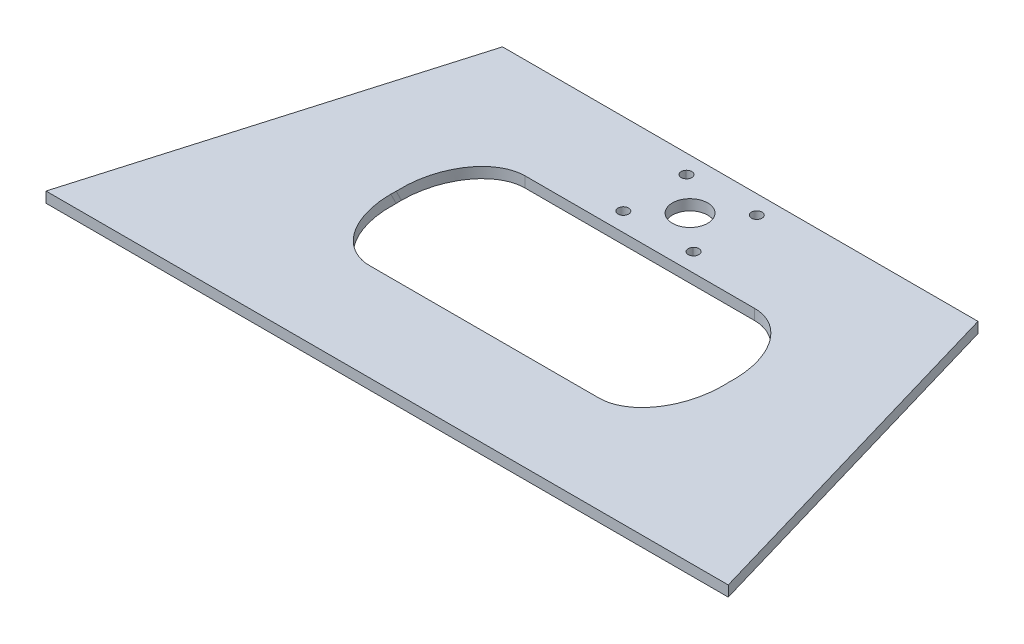
ISO-10303-21;
HEADER;
FILE_DESCRIPTION(('STEP AP214'),'2;1');
FILE_NAME('part.step','',(''),(''),'','','');
FILE_SCHEMA(('AUTOMOTIVE_DESIGN { 1 0 10303 214 1 1 1 1 }'));
ENDSEC;
DATA;
#1=APPLICATION_CONTEXT('core data for automotive mechanical design processes');
#2=APPLICATION_PROTOCOL_DEFINITION('international standard','automotive_design',2000,#1);
#3=PRODUCT_CONTEXT('',#1,'mechanical');
#4=PRODUCT('Part','Part','',(#3));
#5=PRODUCT_RELATED_PRODUCT_CATEGORY('part','',(#4));
#6=PRODUCT_DEFINITION_FORMATION('','',#4);
#7=PRODUCT_DEFINITION_CONTEXT('part definition',#1,'design');
#8=PRODUCT_DEFINITION('design','',#6,#7);
#9=PRODUCT_DEFINITION_SHAPE('','',#8);
#10=(LENGTH_UNIT() NAMED_UNIT(*) SI_UNIT(.MILLI.,.METRE.));
#11=(NAMED_UNIT(*) PLANE_ANGLE_UNIT() SI_UNIT($,.RADIAN.));
#12=(NAMED_UNIT(*) SI_UNIT($,.STERADIAN.) SOLID_ANGLE_UNIT());
#13=UNCERTAINTY_MEASURE_WITH_UNIT(LENGTH_MEASURE(1.E-05),#10,'distance_accuracy_value','');
#14=(GEOMETRIC_REPRESENTATION_CONTEXT(3) GLOBAL_UNCERTAINTY_ASSIGNED_CONTEXT((#13)) GLOBAL_UNIT_ASSIGNED_CONTEXT((#10,
#11,#12)) REPRESENTATION_CONTEXT('',''));
#15=CARTESIAN_POINT('',(0.,0.,0.));
#16=DIRECTION('',(0.,0.,1.));
#17=DIRECTION('',(1.,0.,0.));
#18=AXIS2_PLACEMENT_3D('',#15,#16,#17);
#19=CARTESIAN_POINT('',(0.,3.,0.));
#20=DIRECTION('',(0.,-1.,0.));
#21=DIRECTION('',(0.,0.,-1.));
#22=AXIS2_PLACEMENT_3D('',#19,#20,#21);
#23=PLANE('',#22);
#24=CARTESIAN_POINT('',(106.549966595721,3.,-76.8289375530703));
#25=DIRECTION('',(0.,1.,0.));
#26=DIRECTION('',(0.,0.,1.));
#27=AXIS2_PLACEMENT_3D('',#24,#25,#26);
#28=CIRCLE('',#27,1.5);
#29=CARTESIAN_POINT('',(105.434765336458,3.,-77.8320956419767));
#30=VERTEX_POINT('',#29);
#31=CARTESIAN_POINT('',(107.665201259541,3.,-75.8258166009341));
#32=VERTEX_POINT('',#31);
#33=EDGE_CURVE('E60',#30,#32,#28,.T.);
#34=ORIENTED_EDGE('',*,*,#33,.F.);
#35=CARTESIAN_POINT('',(106.55,3.,-76.8289746895307));
#36=DIRECTION('',(0.,-1.,0.));
#37=DIRECTION('',(0.,0.,-1.));
#38=AXIS2_PLACEMENT_3D('',#35,#36,#37);
#39=CIRCLE('',#38,1.49999999999999);
#40=EDGE_CURVE('E253',#30,#32,#39,.T.);
#41=ORIENTED_EDGE('',*,*,#40,.T.);
#42=EDGE_LOOP('',(#34,#41));
#43=FACE_BOUND('',#42,.T.);
#44=CARTESIAN_POINT('',(106.550033404139,3.,-94.7289375529457));
#45=DIRECTION('',(0.,1.,0.));
#46=DIRECTION('',(0.,0.,1.));
#47=AXIS2_PLACEMENT_3D('',#44,#45,#46);
#48=CIRCLE('',#47,1.5);
#49=CARTESIAN_POINT('',(105.434794998551,3.,-93.7258207607913));
#50=VERTEX_POINT('',#49);
#51=CARTESIAN_POINT('',(107.665238405309,3.,-95.7320914819947));
#52=VERTEX_POINT('',#51);
#53=EDGE_CURVE('E354',#50,#52,#48,.T.);
#54=ORIENTED_EDGE('',*,*,#53,.F.);
#55=CARTESIAN_POINT('',(106.55,3.,-94.7289746895306));
#56=DIRECTION('',(0.,-1.,0.));
#57=DIRECTION('',(0.,0.,-1.));
#58=AXIS2_PLACEMENT_3D('',#55,#56,#57);
#59=CIRCLE('',#58,1.49999999999999);
#60=EDGE_CURVE('E247',#50,#52,#59,.T.);
#61=ORIENTED_EDGE('',*,*,#60,.T.);
#62=EDGE_LOOP('',(#54,#61));
#63=FACE_BOUND('',#62,.T.);
#64=DIRECTION('',(1.,0.,0.));
#65=VECTOR('',#64,1.);
#66=CARTESIAN_POINT('',(0.,3.,0.));
#67=LINE('',#66,#65);
#68=CARTESIAN_POINT('',(0.,3.,0.));
#69=VERTEX_POINT('',#68);
#70=CARTESIAN_POINT('',(193.2,3.,0.));
#71=VERTEX_POINT('',#70);
#72=EDGE_CURVE('E225',#69,#71,#67,.T.);
#73=ORIENTED_EDGE('',*,*,#72,.T.);
#74=DIRECTION('',(-0.281001727065255,0.,-0.959707262339066));
#75=VECTOR('',#74,1.);
#76=CARTESIAN_POINT('',(193.2,3.,0.));
#77=LINE('',#76,#75);
#78=CARTESIAN_POINT('',(163.92005828315,3.,-100.));
#79=VERTEX_POINT('',#78);
#80=EDGE_CURVE('E196',#71,#79,#77,.T.);
#81=ORIENTED_EDGE('',*,*,#80,.T.);
#82=DIRECTION('',(-1.,0.,0.));
#83=VECTOR('',#82,1.);
#84=CARTESIAN_POINT('',(29.2799417168491,3.,-100.));
#85=LINE('',#84,#83);
#86=CARTESIAN_POINT('',(29.2799417168491,3.,-100.));
#87=VERTEX_POINT('',#86);
#88=EDGE_CURVE('E215',#79,#87,#85,.T.);
#89=ORIENTED_EDGE('',*,*,#88,.T.);
#90=DIRECTION('',(-0.281001727065247,0.,0.959707262339068));
#91=VECTOR('',#90,1.);
#92=CARTESIAN_POINT('',(0.,3.,0.));
#93=LINE('',#92,#91);
#94=EDGE_CURVE('E221',#87,#69,#93,.T.);
#95=ORIENTED_EDGE('',*,*,#94,.T.);
#96=EDGE_LOOP('',(#73,#81,#89,#95));
#97=FACE_BOUND('',#96,.T.);
#98=CARTESIAN_POINT('',(96.5999999999996,3.,-85.7789746895304));
#99=DIRECTION('',(0.,-1.,0.));
#100=DIRECTION('',(0.,0.,-1.));
#101=AXIS2_PLACEMENT_3D('',#98,#99,#100);
#102=CIRCLE('',#101,5.);
#103=CARTESIAN_POINT('',(96.5999999999996,3.,-90.7789746895304));
#104=VERTEX_POINT('',#103);
#105=EDGE_CURVE('E259',#104,#104,#102,.T.);
#106=ORIENTED_EDGE('',*,*,#105,.T.);
#107=EDGE_LOOP('',(#106));
#108=FACE_BOUND('',#107,.T.);
#109=CARTESIAN_POINT('',(64.0999999999994,2.99999999999998,-48.0395752908427));
#110=DIRECTION('',(0.,-1.,0.));
#111=DIRECTION('',(0.,0.,1.));
#112=AXIS2_PLACEMENT_3D('',#109,#110,#111);
#113=ELLIPSE('',#112,20.5155954288015,14.5);
#114=CARTESIAN_POINT('',(49.5999999999994,3.,-48.0395752908427));
#115=VERTEX_POINT('',#114);
#116=CARTESIAN_POINT('',(49.6388811468373,3.,-49.5409646205514));
#117=VERTEX_POINT('',#116);
#118=EDGE_CURVE('E298',#115,#117,#113,.T.);
#119=ORIENTED_EDGE('',*,*,#118,.T.);
#120=CARTESIAN_POINT('',(64.0999999999994,3.,-51.04235395026));
#121=DIRECTION('',(0.,-1.,0.));
#122=DIRECTION('',(0.,0.,-1.));
#123=AXIS2_PLACEMENT_3D('',#120,#121,#122);
#124=ELLIPSE('',#123,20.5155954288015,14.5);
#125=CARTESIAN_POINT('',(64.0999999999995,3.,-71.5579493790615));
#126=VERTEX_POINT('',#125);
#127=EDGE_CURVE('E250',#117,#126,#124,.T.);
#128=ORIENTED_EDGE('',*,*,#127,.T.);
#129=DIRECTION('',(1.,0.,0.));
#130=VECTOR('',#129,1.);
#131=CARTESIAN_POINT('',(9.19999999999997,3.,-71.5579493790615));
#132=LINE('',#131,#130);
#133=CARTESIAN_POINT('',(129.1,3.,-71.5579493790615));
#134=VERTEX_POINT('',#133);
#135=EDGE_CURVE('E283',#126,#134,#132,.T.);
#136=ORIENTED_EDGE('',*,*,#135,.T.);
#137=CARTESIAN_POINT('',(129.1,3.,-51.04235395026));
#138=DIRECTION('',(0.,-1.,0.));
#139=DIRECTION('',(0.,0.,-1.));
#140=AXIS2_PLACEMENT_3D('',#137,#138,#139);
#141=ELLIPSE('',#140,20.5155954288015,14.5);
#142=CARTESIAN_POINT('',(143.561118853162,3.,-49.5409646205496));
#143=VERTEX_POINT('',#142);
#144=EDGE_CURVE('E286',#134,#143,#141,.T.);
#145=ORIENTED_EDGE('',*,*,#144,.T.);
#146=CARTESIAN_POINT('',(129.1,2.99999999999998,-48.0395752908427));
#147=DIRECTION('',(0.,-1.,0.));
#148=DIRECTION('',(0.,0.,1.));
#149=AXIS2_PLACEMENT_3D('',#146,#147,#148);
#150=ELLIPSE('',#149,20.5155954288015,14.5);
#151=CARTESIAN_POINT('',(143.6,3.,-48.0395752908427));
#152=VERTEX_POINT('',#151);
#153=EDGE_CURVE('E289',#143,#152,#150,.T.);
#154=ORIENTED_EDGE('',*,*,#153,.T.);
#155=CARTESIAN_POINT('',(129.1,3.,-48.0395752908427));
#156=DIRECTION('',(0.,1.,0.));
#157=DIRECTION('',(0.,0.,-1.));
#158=AXIS2_PLACEMENT_3D('',#155,#156,#157);
#159=ELLIPSE('',#158,20.5155954288014,14.5);
#160=CARTESIAN_POINT('',(129.1,3.,-27.5239798620413));
#161=VERTEX_POINT('',#160);
#162=EDGE_CURVE('E262',#161,#152,#159,.T.);
#163=ORIENTED_EDGE('',*,*,#162,.F.);
#164=DIRECTION('',(-1.,0.,0.));
#165=VECTOR('',#164,1.);
#166=CARTESIAN_POINT('',(96.5999999999995,2.99999999999998,-27.5239798620412));
#167=LINE('',#166,#165);
#168=CARTESIAN_POINT('',(64.0999999999994,3.,-27.5239798620412));
#169=VERTEX_POINT('',#168);
#170=EDGE_CURVE('E292',#161,#169,#167,.T.);
#171=ORIENTED_EDGE('',*,*,#170,.T.);
#172=EDGE_CURVE('E295',#169,#115,#113,.T.);
#173=ORIENTED_EDGE('',*,*,#172,.T.);
#174=EDGE_LOOP('',(#119,#128,#136,#145,#154,#163,#171,#173));
#175=FACE_BOUND('',#174,.T.);
#176=CARTESIAN_POINT('',(86.64996659586,3.,-76.8290118261159));
#177=DIRECTION('',(0.,1.,0.));
#178=DIRECTION('',(0.,0.,1.));
#179=AXIS2_PLACEMENT_3D('',#176,#177,#178);
#180=CIRCLE('',#179,1.5);
#181=CARTESIAN_POINT('',(87.7652050061699,3.,-77.8321286130203));
#182=VERTEX_POINT('',#181);
#183=CARTESIAN_POINT('',(85.5347615899683,3.,-75.8258579023165));
#184=VERTEX_POINT('',#183);
#185=EDGE_CURVE('E346',#182,#184,#180,.T.);
#186=ORIENTED_EDGE('',*,*,#185,.F.);
#187=CARTESIAN_POINT('',(86.6499999999996,3.,-76.8289746895307));
#188=DIRECTION('',(0.,-1.,0.));
#189=DIRECTION('',(0.,0.,-1.));
#190=AXIS2_PLACEMENT_3D('',#187,#188,#189);
#191=CIRCLE('',#190,1.49999999999999);
#192=EDGE_CURVE('E246',#182,#184,#191,.T.);
#193=ORIENTED_EDGE('',*,*,#192,.T.);
#194=EDGE_LOOP('',(#186,#193));
#195=FACE_BOUND('',#194,.T.);
#196=CARTESIAN_POINT('',(86.6500334042779,3.,-94.7290118259911));
#197=DIRECTION('',(0.,1.,0.));
#198=DIRECTION('',(0.,0.,1.));
#199=AXIS2_PLACEMENT_3D('',#196,#197,#198);
#200=CIRCLE('',#199,1.5);
#201=CARTESIAN_POINT('',(87.7652346652798,3.,-93.7258537390179));
#202=VERTEX_POINT('',#201);
#203=CARTESIAN_POINT('',(85.534798738719,3.,-95.732132776194));
#204=VERTEX_POINT('',#203);
#205=EDGE_CURVE('E52',#202,#204,#200,.T.);
#206=ORIENTED_EDGE('',*,*,#205,.F.);
#207=CARTESIAN_POINT('',(86.6499999999996,3.,-94.7289746895306));
#208=DIRECTION('',(0.,-1.,0.));
#209=DIRECTION('',(0.,0.,-1.));
#210=AXIS2_PLACEMENT_3D('',#207,#208,#209);
#211=CIRCLE('',#210,1.49999999999999);
#212=EDGE_CURVE('E183',#202,#204,#211,.T.);
#213=ORIENTED_EDGE('',*,*,#212,.T.);
#214=EDGE_LOOP('',(#206,#213));
#215=FACE_BOUND('',#214,.T.);
#216=ADVANCED_FACE('F38',(#43,#63,#97,#108,#175,#195,#215),#23,.F.);
#217=CARTESIAN_POINT('',(0.,0.,0.));
#218=DIRECTION('',(0.,-1.,0.));
#219=DIRECTION('',(0.,0.,-1.));
#220=AXIS2_PLACEMENT_3D('',#217,#218,#219);
#221=PLANE('',#220);
#222=DIRECTION('',(-1.,0.,0.));
#223=VECTOR('',#222,1.);
#224=CARTESIAN_POINT('',(29.2799417168491,0.,-100.));
#225=LINE('',#224,#223);
#226=CARTESIAN_POINT('',(163.92005828315,0.,-100.));
#227=VERTEX_POINT('',#226);
#228=CARTESIAN_POINT('',(29.2799417168491,0.,-100.));
#229=VERTEX_POINT('',#228);
#230=EDGE_CURVE('E224',#227,#229,#225,.T.);
#231=ORIENTED_EDGE('',*,*,#230,.F.);
#232=DIRECTION('',(-0.281001727065255,0.,-0.959707262339066));
#233=VECTOR('',#232,1.);
#234=CARTESIAN_POINT('',(193.2,0.,0.));
#235=LINE('',#234,#233);
#236=CARTESIAN_POINT('',(193.2,0.,0.));
#237=VERTEX_POINT('',#236);
#238=EDGE_CURVE('E200',#237,#227,#235,.T.);
#239=ORIENTED_EDGE('',*,*,#238,.F.);
#240=DIRECTION('',(1.,0.,0.));
#241=VECTOR('',#240,1.);
#242=CARTESIAN_POINT('',(0.,0.,0.));
#243=LINE('',#242,#241);
#244=CARTESIAN_POINT('',(0.,0.,0.));
#245=VERTEX_POINT('',#244);
#246=EDGE_CURVE('E220',#245,#237,#243,.T.);
#247=ORIENTED_EDGE('',*,*,#246,.F.);
#248=DIRECTION('',(-0.281001727065247,0.,0.959707262339068));
#249=VECTOR('',#248,1.);
#250=CARTESIAN_POINT('',(0.,0.,0.));
#251=LINE('',#250,#249);
#252=EDGE_CURVE('E216',#229,#245,#251,.T.);
#253=ORIENTED_EDGE('',*,*,#252,.F.);
#254=EDGE_LOOP('',(#231,#239,#247,#253));
#255=FACE_BOUND('',#254,.T.);
#256=CARTESIAN_POINT('',(96.5999999999996,0.,-85.7789746895304));
#257=DIRECTION('',(0.,-1.,0.));
#258=DIRECTION('',(0.,0.,-1.));
#259=AXIS2_PLACEMENT_3D('',#256,#257,#258);
#260=CIRCLE('',#259,5.);
#261=CARTESIAN_POINT('',(96.5999999999996,0.,-90.7789746895304));
#262=VERTEX_POINT('',#261);
#263=EDGE_CURVE('E280',#262,#262,#260,.T.);
#264=ORIENTED_EDGE('',*,*,#263,.F.);
#265=EDGE_LOOP('',(#264));
#266=FACE_BOUND('',#265,.T.);
#267=CARTESIAN_POINT('',(129.1,0.,-48.0395752908427));
#268=DIRECTION('',(0.,1.,0.));
#269=DIRECTION('',(0.,0.,-1.));
#270=AXIS2_PLACEMENT_3D('',#267,#268,#269);
#271=ELLIPSE('',#270,20.5155954288014,14.5);
#272=CARTESIAN_POINT('',(143.561118853162,0.,-49.5409646205496));
#273=VERTEX_POINT('',#272);
#274=CARTESIAN_POINT('',(129.1,0.,-27.5239798620413));
#275=VERTEX_POINT('',#274);
#276=EDGE_CURVE('E192',#273,#275,#271,.F.);
#277=ORIENTED_EDGE('',*,*,#276,.F.);
#278=CARTESIAN_POINT('',(129.1,0.,-51.04235395026));
#279=DIRECTION('',(0.,-1.,0.));
#280=DIRECTION('',(0.,0.,1.));
#281=AXIS2_PLACEMENT_3D('',#278,#279,#280);
#282=ELLIPSE('',#281,20.5155954288015,14.5);
#283=CARTESIAN_POINT('',(143.6,0.,-51.0423539502601));
#284=VERTEX_POINT('',#283);
#285=EDGE_CURVE('E299',#273,#284,#282,.F.);
#286=ORIENTED_EDGE('',*,*,#285,.T.);
#287=CARTESIAN_POINT('',(129.1,0.,-51.04235395026));
#288=DIRECTION('',(0.,-1.,0.));
#289=DIRECTION('',(0.,0.,-1.));
#290=AXIS2_PLACEMENT_3D('',#287,#288,#289);
#291=ELLIPSE('',#290,20.5155954288015,14.5);
#292=CARTESIAN_POINT('',(129.1,0.,-71.5579493790615));
#293=VERTEX_POINT('',#292);
#294=EDGE_CURVE('E273',#293,#284,#291,.T.);
#295=ORIENTED_EDGE('',*,*,#294,.F.);
#296=DIRECTION('',(1.,0.,0.));
#297=VECTOR('',#296,1.);
#298=CARTESIAN_POINT('',(9.19999999999994,0.,-71.5579493790615));
#299=LINE('',#298,#297);
#300=CARTESIAN_POINT('',(64.0999999999995,0.,-71.5579493790615));
#301=VERTEX_POINT('',#300);
#302=EDGE_CURVE('E270',#301,#293,#299,.T.);
#303=ORIENTED_EDGE('',*,*,#302,.F.);
#304=CARTESIAN_POINT('',(64.0999999999994,0.,-51.04235395026));
#305=DIRECTION('',(0.,-1.,0.));
#306=DIRECTION('',(0.,0.,1.));
#307=AXIS2_PLACEMENT_3D('',#304,#305,#306);
#308=ELLIPSE('',#307,20.5155954288015,14.5);
#309=CARTESIAN_POINT('',(49.5999999999994,0.,-51.04235395026));
#310=VERTEX_POINT('',#309);
#311=EDGE_CURVE('E302',#301,#310,#308,.F.);
#312=ORIENTED_EDGE('',*,*,#311,.T.);
#313=CARTESIAN_POINT('',(49.6388811468372,0.,-49.5409646205544));
#314=VERTEX_POINT('',#313);
#315=EDGE_CURVE('E305',#310,#314,#308,.F.);
#316=ORIENTED_EDGE('',*,*,#315,.T.);
#317=CARTESIAN_POINT('',(64.0999999999994,0.,-48.0395752908427));
#318=DIRECTION('',(0.,1.,0.));
#319=DIRECTION('',(0.,0.,1.));
#320=AXIS2_PLACEMENT_3D('',#317,#318,#319);
#321=ELLIPSE('',#320,20.5155954288015,14.5);
#322=CARTESIAN_POINT('',(64.0999999999994,0.,-27.5239798620412));
#323=VERTEX_POINT('',#322);
#324=EDGE_CURVE('E266',#323,#314,#321,.F.);
#325=ORIENTED_EDGE('',*,*,#324,.F.);
#326=DIRECTION('',(-1.,0.,0.));
#327=VECTOR('',#326,1.);
#328=CARTESIAN_POINT('',(9.19999999999997,0.,-27.5239798620412));
#329=LINE('',#328,#327);
#330=EDGE_CURVE('E263',#275,#323,#329,.T.);
#331=ORIENTED_EDGE('',*,*,#330,.F.);
#332=EDGE_LOOP('',(#277,#286,#295,#303,#312,#316,#325,#331));
#333=FACE_BOUND('',#332,.T.);
#334=CARTESIAN_POINT('',(106.55,0.,-94.7289746895306));
#335=DIRECTION('',(0.,-1.,0.));
#336=DIRECTION('',(0.,0.,-1.));
#337=AXIS2_PLACEMENT_3D('',#334,#335,#336);
#338=CIRCLE('',#337,1.49999999999999);
#339=CARTESIAN_POINT('',(105.434794998551,0.,-93.7258207607913));
#340=VERTEX_POINT('',#339);
#341=CARTESIAN_POINT('',(107.665238405309,0.,-95.7320914819947));
#342=VERTEX_POINT('',#341);
#343=EDGE_CURVE('E185',#340,#342,#338,.T.);
#344=ORIENTED_EDGE('',*,*,#343,.F.);
#345=CARTESIAN_POINT('',(106.550033404139,0.,-94.7289375529457));
#346=DIRECTION('',(0.,1.,0.));
#347=DIRECTION('',(0.,0.,1.));
#348=AXIS2_PLACEMENT_3D('',#345,#346,#347);
#349=CIRCLE('',#348,1.5);
#350=EDGE_CURVE('E267',#340,#342,#349,.T.);
#351=ORIENTED_EDGE('',*,*,#350,.T.);
#352=EDGE_LOOP('',(#344,#351));
#353=FACE_BOUND('',#352,.T.);
#354=CARTESIAN_POINT('',(86.6499999999996,0.,-76.8289746895307));
#355=DIRECTION('',(0.,-1.,0.));
#356=DIRECTION('',(0.,0.,-1.));
#357=AXIS2_PLACEMENT_3D('',#354,#355,#356);
#358=CIRCLE('',#357,1.49999999999999);
#359=CARTESIAN_POINT('',(87.7652050061699,0.,-77.8321286130203));
#360=VERTEX_POINT('',#359);
#361=CARTESIAN_POINT('',(85.5347615899683,0.,-75.8258579023165));
#362=VERTEX_POINT('',#361);
#363=EDGE_CURVE('E186',#360,#362,#358,.T.);
#364=ORIENTED_EDGE('',*,*,#363,.F.);
#365=CARTESIAN_POINT('',(86.64996659586,0.,-76.8290118261159));
#366=DIRECTION('',(0.,1.,0.));
#367=DIRECTION('',(0.,0.,1.));
#368=AXIS2_PLACEMENT_3D('',#365,#366,#367);
#369=CIRCLE('',#368,1.5);
#370=EDGE_CURVE('E348',#360,#362,#369,.T.);
#371=ORIENTED_EDGE('',*,*,#370,.T.);
#372=EDGE_LOOP('',(#364,#371));
#373=FACE_BOUND('',#372,.T.);
#374=CARTESIAN_POINT('',(106.55,0.,-76.8289746895307));
#375=DIRECTION('',(0.,-1.,0.));
#376=DIRECTION('',(0.,0.,-1.));
#377=AXIS2_PLACEMENT_3D('',#374,#375,#376);
#378=CIRCLE('',#377,1.49999999999999);
#379=CARTESIAN_POINT('',(105.434765336458,0.,-77.8320956419767));
#380=VERTEX_POINT('',#379);
#381=CARTESIAN_POINT('',(107.665201259541,0.,-75.8258166009341));
#382=VERTEX_POINT('',#381);
#383=EDGE_CURVE('E189',#380,#382,#378,.T.);
#384=ORIENTED_EDGE('',*,*,#383,.F.);
#385=CARTESIAN_POINT('',(106.549966595721,0.,-76.8289375530703));
#386=DIRECTION('',(0.,1.,0.));
#387=DIRECTION('',(0.,0.,1.));
#388=AXIS2_PLACEMENT_3D('',#385,#386,#387);
#389=CIRCLE('',#388,1.5);
#390=EDGE_CURVE('E345',#380,#382,#389,.T.);
#391=ORIENTED_EDGE('',*,*,#390,.T.);
#392=EDGE_LOOP('',(#384,#391));
#393=FACE_BOUND('',#392,.T.);
#394=CARTESIAN_POINT('',(86.6499999999996,0.,-94.7289746895306));
#395=DIRECTION('',(0.,-1.,0.));
#396=DIRECTION('',(0.,0.,-1.));
#397=AXIS2_PLACEMENT_3D('',#394,#395,#396);
#398=CIRCLE('',#397,1.49999999999999);
#399=CARTESIAN_POINT('',(87.7652346652798,0.,-93.7258537390179));
#400=VERTEX_POINT('',#399);
#401=CARTESIAN_POINT('',(85.534798738719,0.,-95.732132776194));
#402=VERTEX_POINT('',#401);
#403=EDGE_CURVE('E181',#400,#402,#398,.T.);
#404=ORIENTED_EDGE('',*,*,#403,.F.);
#405=CARTESIAN_POINT('',(86.6500334042779,0.,-94.7290118259911));
#406=DIRECTION('',(0.,1.,0.));
#407=DIRECTION('',(0.,0.,1.));
#408=AXIS2_PLACEMENT_3D('',#405,#406,#407);
#409=CIRCLE('',#408,1.5);
#410=EDGE_CURVE('E172',#400,#402,#409,.T.);
#411=ORIENTED_EDGE('',*,*,#410,.T.);
#412=EDGE_LOOP('',(#404,#411));
#413=FACE_BOUND('',#412,.T.);
#414=ADVANCED_FACE('F184',(#255,#266,#333,#353,#373,#393,#413),#221,.T.);
#415=CARTESIAN_POINT('',(0.,3.,0.));
#416=DIRECTION('',(0.959707262339068,0.,0.281001727065248));
#417=DIRECTION('',(0.281001727065248,0.,-0.959707262339068));
#418=AXIS2_PLACEMENT_3D('',#415,#416,#417);
#419=PLANE('',#418);
#420=ORIENTED_EDGE('',*,*,#252,.T.);
#421=DIRECTION('',(0.,-1.,0.));
#422=VECTOR('',#421,1.);
#423=CARTESIAN_POINT('',(0.,3.,0.));
#424=LINE('',#423,#422);
#425=EDGE_CURVE('E209',#69,#245,#424,.T.);
#426=ORIENTED_EDGE('',*,*,#425,.F.);
#427=ORIENTED_EDGE('',*,*,#94,.F.);
#428=DIRECTION('',(0.,-1.,0.));
#429=VECTOR('',#428,1.);
#430=CARTESIAN_POINT('',(29.2799417168491,3.,-100.));
#431=LINE('',#430,#429);
#432=EDGE_CURVE('E212',#87,#229,#431,.T.);
#433=ORIENTED_EDGE('',*,*,#432,.T.);
#434=EDGE_LOOP('',(#420,#426,#427,#433));
#435=FACE_BOUND('',#434,.T.);
#436=ADVANCED_FACE('F385',(#435),#419,.F.);
#437=CARTESIAN_POINT('',(0.,3.,0.));
#438=DIRECTION('',(0.,0.,-1.));
#439=DIRECTION('',(-1.,0.,0.));
#440=AXIS2_PLACEMENT_3D('',#437,#438,#439);
#441=PLANE('',#440);
#442=ORIENTED_EDGE('',*,*,#246,.T.);
#443=DIRECTION('',(0.,-1.,0.));
#444=VECTOR('',#443,1.);
#445=CARTESIAN_POINT('',(193.2,3.,0.));
#446=LINE('',#445,#444);
#447=EDGE_CURVE('E206',#71,#237,#446,.T.);
#448=ORIENTED_EDGE('',*,*,#447,.F.);
#449=ORIENTED_EDGE('',*,*,#72,.F.);
#450=ORIENTED_EDGE('',*,*,#425,.T.);
#451=EDGE_LOOP('',(#442,#448,#449,#450));
#452=FACE_BOUND('',#451,.T.);
#453=ADVANCED_FACE('F390',(#452),#441,.F.);
#454=CARTESIAN_POINT('',(29.2799417168491,3.,-100.));
#455=DIRECTION('',(0.,0.,1.));
#456=DIRECTION('',(1.,0.,0.));
#457=AXIS2_PLACEMENT_3D('',#454,#455,#456);
#458=PLANE('',#457);
#459=ORIENTED_EDGE('',*,*,#88,.F.);
#460=DIRECTION('',(0.,-1.,0.));
#461=VECTOR('',#460,1.);
#462=CARTESIAN_POINT('',(163.92005828315,3.,-100.));
#463=LINE('',#462,#461);
#464=EDGE_CURVE('E199',#79,#227,#463,.T.);
#465=ORIENTED_EDGE('',*,*,#464,.T.);
#466=ORIENTED_EDGE('',*,*,#230,.T.);
#467=ORIENTED_EDGE('',*,*,#432,.F.);
#468=EDGE_LOOP('',(#459,#465,#466,#467));
#469=FACE_BOUND('',#468,.T.);
#470=ADVANCED_FACE('F397',(#469),#458,.F.);
#471=CARTESIAN_POINT('',(193.2,3.,0.));
#472=DIRECTION('',(-0.959707262339066,0.,0.281001727065255));
#473=DIRECTION('',(0.281001727065255,0.,0.959707262339066));
#474=AXIS2_PLACEMENT_3D('',#471,#472,#473);
#475=PLANE('',#474);
#476=ORIENTED_EDGE('',*,*,#238,.T.);
#477=ORIENTED_EDGE('',*,*,#464,.F.);
#478=ORIENTED_EDGE('',*,*,#80,.F.);
#479=ORIENTED_EDGE('',*,*,#447,.T.);
#480=EDGE_LOOP('',(#476,#477,#478,#479));
#481=FACE_BOUND('',#480,.T.);
#482=ADVANCED_FACE('F400',(#481),#475,.F.);
#483=CARTESIAN_POINT('',(96.5999999999996,0.,-85.7789746895304));
#484=DIRECTION('',(0.,-1.,0.));
#485=DIRECTION('',(0.,0.,-1.));
#486=AXIS2_PLACEMENT_3D('',#483,#484,#485);
#487=CYLINDRICAL_SURFACE('',#486,5.);
#488=ORIENTED_EDGE('',*,*,#263,.T.);
#489=EDGE_LOOP('',(#488));
#490=FACE_BOUND('',#489,.T.);
#491=ORIENTED_EDGE('',*,*,#105,.F.);
#492=EDGE_LOOP('',(#491));
#493=FACE_BOUND('',#492,.T.);
#494=ADVANCED_FACE('F405',(#490,#493),#487,.F.);
#495=CARTESIAN_POINT('',(106.55,0.,-76.8289746895307));
#496=DIRECTION('',(0.,-1.,0.));
#497=DIRECTION('',(0.,0.,-1.));
#498=AXIS2_PLACEMENT_3D('',#495,#496,#497);
#499=CYLINDRICAL_SURFACE('',#498,1.49999999999999);
#500=ORIENTED_EDGE('',*,*,#40,.F.);
#501=DIRECTION('',(0.,1.,0.));
#502=VECTOR('',#501,1.);
#503=CARTESIAN_POINT('',(105.434765336458,1.5,-77.8320956419767));
#504=LINE('',#503,#502);
#505=EDGE_CURVE('E243',#30,#380,#504,.F.);
#506=ORIENTED_EDGE('',*,*,#505,.T.);
#507=ORIENTED_EDGE('',*,*,#383,.T.);
#508=DIRECTION('',(0.,1.,0.));
#509=VECTOR('',#508,1.);
#510=CARTESIAN_POINT('',(107.665201259541,1.5,-75.8258166009341));
#511=LINE('',#510,#509);
#512=EDGE_CURVE('E241',#382,#32,#511,.T.);
#513=ORIENTED_EDGE('',*,*,#512,.T.);
#514=EDGE_LOOP('',(#500,#506,#507,#513));
#515=FACE_BOUND('',#514,.T.);
#516=ADVANCED_FACE('F342',(#515),#499,.F.);
#517=CARTESIAN_POINT('',(106.55,0.,-94.7289746895306));
#518=DIRECTION('',(0.,-1.,0.));
#519=DIRECTION('',(0.,0.,-1.));
#520=AXIS2_PLACEMENT_3D('',#517,#518,#519);
#521=CYLINDRICAL_SURFACE('',#520,1.49999999999999);
#522=ORIENTED_EDGE('',*,*,#60,.F.);
#523=DIRECTION('',(0.,1.,0.));
#524=VECTOR('',#523,1.);
#525=CARTESIAN_POINT('',(105.434794998551,1.5,-93.7258207607913));
#526=LINE('',#525,#524);
#527=EDGE_CURVE('E232',#50,#340,#526,.F.);
#528=ORIENTED_EDGE('',*,*,#527,.T.);
#529=ORIENTED_EDGE('',*,*,#343,.T.);
#530=DIRECTION('',(0.,1.,0.));
#531=VECTOR('',#530,1.);
#532=CARTESIAN_POINT('',(107.665238405309,1.5,-95.7320914819947));
#533=LINE('',#532,#531);
#534=EDGE_CURVE('E219',#342,#52,#533,.T.);
#535=ORIENTED_EDGE('',*,*,#534,.T.);
#536=EDGE_LOOP('',(#522,#528,#529,#535));
#537=FACE_BOUND('',#536,.T.);
#538=ADVANCED_FACE('F362',(#537),#521,.F.);
#539=CARTESIAN_POINT('',(86.6499999999996,0.,-94.7289746895306));
#540=DIRECTION('',(0.,-1.,0.));
#541=DIRECTION('',(0.,0.,-1.));
#542=AXIS2_PLACEMENT_3D('',#539,#540,#541);
#543=CYLINDRICAL_SURFACE('',#542,1.49999999999999);
#544=ORIENTED_EDGE('',*,*,#212,.F.);
#545=DIRECTION('',(0.,1.,0.));
#546=VECTOR('',#545,1.);
#547=CARTESIAN_POINT('',(87.7652346652798,1.5,-93.7258537390179));
#548=LINE('',#547,#546);
#549=EDGE_CURVE('E11',#202,#400,#548,.F.);
#550=ORIENTED_EDGE('',*,*,#549,.T.);
#551=ORIENTED_EDGE('',*,*,#403,.T.);
#552=DIRECTION('',(0.,1.,0.));
#553=VECTOR('',#552,1.);
#554=CARTESIAN_POINT('',(85.534798738719,1.5,-95.732132776194));
#555=LINE('',#554,#553);
#556=EDGE_CURVE('E45',#402,#204,#555,.T.);
#557=ORIENTED_EDGE('',*,*,#556,.T.);
#558=EDGE_LOOP('',(#544,#550,#551,#557));
#559=FACE_BOUND('',#558,.T.);
#560=ADVANCED_FACE('F180',(#559),#543,.F.);
#561=CARTESIAN_POINT('',(86.6499999999996,0.,-76.8289746895307));
#562=DIRECTION('',(0.,-1.,0.));
#563=DIRECTION('',(0.,0.,-1.));
#564=AXIS2_PLACEMENT_3D('',#561,#562,#563);
#565=CYLINDRICAL_SURFACE('',#564,1.49999999999999);
#566=ORIENTED_EDGE('',*,*,#192,.F.);
#567=DIRECTION('',(0.,1.,0.));
#568=VECTOR('',#567,1.);
#569=CARTESIAN_POINT('',(87.7652050061699,1.5,-77.8321286130203));
#570=LINE('',#569,#568);
#571=EDGE_CURVE('E238',#182,#360,#570,.F.);
#572=ORIENTED_EDGE('',*,*,#571,.T.);
#573=ORIENTED_EDGE('',*,*,#363,.T.);
#574=DIRECTION('',(0.,1.,0.));
#575=VECTOR('',#574,1.);
#576=CARTESIAN_POINT('',(85.5347615899683,1.5,-75.8258579023165));
#577=LINE('',#576,#575);
#578=EDGE_CURVE('E235',#362,#184,#577,.T.);
#579=ORIENTED_EDGE('',*,*,#578,.T.);
#580=EDGE_LOOP('',(#566,#572,#573,#579));
#581=FACE_BOUND('',#580,.T.);
#582=ADVANCED_FACE('F381',(#581),#565,.F.);
#583=CARTESIAN_POINT('',(64.0999999999994,-7.,-27.5239798620412));
#584=DIRECTION('',(0.,0.,1.));
#585=DIRECTION('',(1.,0.,0.));
#586=AXIS2_PLACEMENT_3D('',#583,#584,#585);
#587=PLANE('',#586);
#588=ORIENTED_EDGE('',*,*,#330,.T.);
#589=DIRECTION('',(0.,1.,0.));
#590=VECTOR('',#589,1.);
#591=CARTESIAN_POINT('',(64.0999999999994,1.5,-27.5239798620412));
#592=LINE('',#591,#590);
#593=EDGE_CURVE('E308',#323,#169,#592,.T.);
#594=ORIENTED_EDGE('',*,*,#593,.T.);
#595=ORIENTED_EDGE('',*,*,#170,.F.);
#596=DIRECTION('',(0.,1.,0.));
#597=VECTOR('',#596,1.);
#598=CARTESIAN_POINT('',(129.1,-6.99999999999999,-27.5239798620412));
#599=LINE('',#598,#597);
#600=EDGE_CURVE('E318',#275,#161,#599,.T.);
#601=ORIENTED_EDGE('',*,*,#600,.F.);
#602=EDGE_LOOP('',(#588,#594,#595,#601));
#603=FACE_BOUND('',#602,.T.);
#604=ADVANCED_FACE('F329',(#603),#587,.F.);
#605=CARTESIAN_POINT('',(64.0999999999994,-7.,-48.0395752908427));
#606=DIRECTION('',(0.,1.,0.));
#607=DIRECTION('',(0.,0.,1.));
#608=AXIS2_PLACEMENT_3D('',#605,#606,#607);
#609=ELLIPSE('',#608,20.5155954288015,14.5);
#610=DIRECTION('',(0.,1.,0.));
#611=VECTOR('',#610,1.);
#612=SURFACE_OF_LINEAR_EXTRUSION('',#609,#611);
#613=ORIENTED_EDGE('',*,*,#593,.F.);
#614=ORIENTED_EDGE('',*,*,#324,.T.);
#615=CARTESIAN_POINT('',(50.0380503622644,-7.,-53.0442063898716));
#616=CARTESIAN_POINT('',(49.964359717433,-6.17134305892181,-52.6294941618387));
#617=CARTESIAN_POINT('',(49.9002759410238,-5.34201217488287,-52.2144446477376));
#618=CARTESIAN_POINT('',(49.7908220425167,-3.68233696010791,-51.3838384260592));
#619=CARTESIAN_POINT('',(49.7454524806224,-2.85199259977997,-50.9682817036724));
#620=CARTESIAN_POINT('',(49.6729588721765,-1.19130659468814,-50.1371696213148));
#621=CARTESIAN_POINT('',(49.6458209683537,-0.360965428637972,-49.72161450092));
#622=CARTESIAN_POINT('',(49.6094839537083,1.30000680492889,-48.8903591726677));
#623=CARTESIAN_POINT('',(49.6002840885265,2.1306378587854,-48.4746589716466));
#624=CARTESIAN_POINT('',(49.6000021612994,2.97416633493186,-48.0525040872018));
#625=CARTESIAN_POINT('',(49.6000000018856,2.98708317015572,-48.046039687676));
#626=CARTESIAN_POINT('',(49.5999999999993,2.99999999999998,-48.0395752908427));
#627=B_SPLINE_CURVE_WITH_KNOTS('',3,(#615,#616,#617,#618,#619,#620,#621,#622,#623,#624,#625,
#626),.UNSPECIFIED.,.F.,.F.,(4,2,2,2,2,4),(0.,2.78862709260098,5.57733765571683,
8.36392620822776,11.1503975721296,11.1937299828238),.UNSPECIFIED.);
#628=EDGE_CURVE('E310',#314,#115,#627,.T.);
#629=ORIENTED_EDGE('',*,*,#628,.T.);
#630=ORIENTED_EDGE('',*,*,#172,.F.);
#631=EDGE_LOOP('',(#613,#614,#629,#630));
#632=FACE_BOUND('',#631,.T.);
#633=ADVANCED_FACE('F323',(#632),#612,.F.);
#634=CARTESIAN_POINT('',(129.1,-7.,-48.0395752908427));
#635=DIRECTION('',(0.,1.,0.));
#636=DIRECTION('',(0.,0.,-1.));
#637=AXIS2_PLACEMENT_3D('',#634,#635,#636);
#638=ELLIPSE('',#637,20.5155954288014,14.5);
#639=DIRECTION('',(0.,1.,0.));
#640=VECTOR('',#639,1.);
#641=SURFACE_OF_LINEAR_EXTRUSION('',#638,#640);
#642=CARTESIAN_POINT('',(143.161949637735,-7.,-53.0442063898716));
#643=CARTESIAN_POINT('',(143.235640282566,-6.17134305892777,-52.6294941618268));
#644=CARTESIAN_POINT('',(143.299724058975,-5.34201217488583,-52.2144446477316));
#645=CARTESIAN_POINT('',(143.409177957482,-3.68233696010492,-51.3838384260653));
#646=CARTESIAN_POINT('',(143.454547519376,-2.85199259977402,-50.9682817036844));
#647=CARTESIAN_POINT('',(143.527041127822,-1.1913065946942,-50.1371696213029));
#648=CARTESIAN_POINT('',(143.554179031645,-0.360965428658968,-49.7216145008782));
#649=CARTESIAN_POINT('',(143.590516046291,1.30000680494966,-48.8903591727093));
#650=CARTESIAN_POINT('',(143.599715911472,2.13063785886287,-48.4746589718015));
#651=CARTESIAN_POINT('',(143.599997838699,2.97416633493425,-48.0525040872066));
#652=CARTESIAN_POINT('',(143.599999998113,2.98708317015694,-48.0460396876785));
#653=CARTESIAN_POINT('',(143.6,2.99999999999998,-48.0395752908427));
#654=B_SPLINE_CURVE_WITH_KNOTS('',3,(#642,#643,#644,#645,#646,#647,#648,#649,#650,#651,#652,
#653),.UNSPECIFIED.,.F.,.F.,(4,2,2,2,2,4),(0.,2.78862709260098,5.57733765571676,
8.36392620822771,11.1503975721296,11.1937299828238),.UNSPECIFIED.);
#655=EDGE_CURVE('E456',#152,#273,#654,.F.);
#656=ORIENTED_EDGE('',*,*,#655,.T.);
#657=ORIENTED_EDGE('',*,*,#276,.T.);
#658=ORIENTED_EDGE('',*,*,#600,.T.);
#659=ORIENTED_EDGE('',*,*,#162,.T.);
#660=EDGE_LOOP('',(#656,#657,#658,#659));
#661=FACE_BOUND('',#660,.T.);
#662=ADVANCED_FACE('F328',(#661),#641,.F.);
#663=CARTESIAN_POINT('',(64.0999999999994,-40.2845577931788,-91.364224098734));
#664=DIRECTION('',(0.,0.706779388895714,0.707434021964028));
#665=DIRECTION('',(-1.,0.,0.));
#666=AXIS2_PLACEMENT_3D('',#663,#664,#665);
#667=CYLINDRICAL_SURFACE('',#666,14.5);
#668=CARTESIAN_POINT('',(49.6729671137166,4.10732985603375,-48.9867868771124));
#669=CARTESIAN_POINT('',(49.6323572483054,2.96618665367045,-49.5578869527071));
#670=CARTESIAN_POINT('',(49.6087427337426,1.82462857659892,-50.1291946583471));
#671=CARTESIAN_POINT('',(49.6007467828429,0.468254060326865,-50.8080100670137));
#672=CARTESIAN_POINT('',(49.6000782715583,0.253502311625161,-50.9154853950284));
#673=CARTESIAN_POINT('',(49.6000021602187,0.0258336700337781,-51.029425151416));
#674=CARTESIAN_POINT('',(49.6000000008007,0.0129168348698428,-51.0358895509116));
#675=CARTESIAN_POINT('',(49.5999999999994,0.,-51.04235395026));
#676=B_SPLINE_CURVE_WITH_KNOTS('',3,(#668,#669,#670,#671,#672,#673,#674,#675),.UNSPECIFIED.,.F.,
.F.,(4,2,2,4),(0.,3.829880123102,4.55031307091054,4.59364548160471),.UNSPECIFIED.);
#677=EDGE_CURVE('E455',#117,#310,#676,.T.);
#678=ORIENTED_EDGE('',*,*,#677,.F.);
#679=ORIENTED_EDGE('',*,*,#118,.F.);
#680=ORIENTED_EDGE('',*,*,#628,.F.);
#681=ORIENTED_EDGE('',*,*,#315,.F.);
#682=EDGE_LOOP('',(#678,#679,#680,#681));
#683=FACE_BOUND('',#682,.T.);
#684=ADVANCED_FACE('F320',(#683),#667,.F.);
#685=CARTESIAN_POINT('',(64.0999999999994,10.,-51.04235395026));
#686=DIRECTION('',(0.,-1.,0.));
#687=DIRECTION('',(0.,0.,-1.));
#688=AXIS2_PLACEMENT_3D('',#685,#686,#687);
#689=ELLIPSE('',#688,20.5155954288015,14.5);
#690=DIRECTION('',(0.,-1.,0.));
#691=VECTOR('',#690,1.);
#692=SURFACE_OF_LINEAR_EXTRUSION('',#689,#691);
#693=ORIENTED_EDGE('',*,*,#311,.F.);
#694=DIRECTION('',(0.,-1.,0.));
#695=VECTOR('',#694,1.);
#696=CARTESIAN_POINT('',(64.0999999999995,1.5,-71.5579493790615));
#697=LINE('',#696,#695);
#698=EDGE_CURVE('E306',#301,#126,#697,.F.);
#699=ORIENTED_EDGE('',*,*,#698,.T.);
#700=ORIENTED_EDGE('',*,*,#127,.F.);
#701=ORIENTED_EDGE('',*,*,#677,.T.);
#702=EDGE_LOOP('',(#693,#699,#700,#701));
#703=FACE_BOUND('',#702,.T.);
#704=ADVANCED_FACE('F409',(#703),#692,.F.);
#705=CARTESIAN_POINT('',(129.1,10.,-71.5579493790615));
#706=DIRECTION('',(0.,0.,-1.));
#707=DIRECTION('',(-1.,0.,0.));
#708=AXIS2_PLACEMENT_3D('',#705,#706,#707);
#709=PLANE('',#708);
#710=ORIENTED_EDGE('',*,*,#698,.F.);
#711=ORIENTED_EDGE('',*,*,#302,.T.);
#712=DIRECTION('',(0.,-1.,0.));
#713=VECTOR('',#712,1.);
#714=CARTESIAN_POINT('',(129.1,10.,-71.5579493790615));
#715=LINE('',#714,#713);
#716=EDGE_CURVE('E203',#134,#293,#715,.T.);
#717=ORIENTED_EDGE('',*,*,#716,.F.);
#718=ORIENTED_EDGE('',*,*,#135,.F.);
#719=EDGE_LOOP('',(#710,#711,#717,#718));
#720=FACE_BOUND('',#719,.T.);
#721=ADVANCED_FACE('F438',(#720),#709,.F.);
#722=CARTESIAN_POINT('',(129.1,10.,-51.04235395026));
#723=DIRECTION('',(0.,-1.,0.));
#724=DIRECTION('',(0.,0.,-1.));
#725=AXIS2_PLACEMENT_3D('',#722,#723,#724);
#726=ELLIPSE('',#725,20.5155954288015,14.5);
#727=DIRECTION('',(0.,-1.,0.));
#728=VECTOR('',#727,1.);
#729=SURFACE_OF_LINEAR_EXTRUSION('',#726,#728);
#730=ORIENTED_EDGE('',*,*,#144,.F.);
#731=ORIENTED_EDGE('',*,*,#716,.T.);
#732=ORIENTED_EDGE('',*,*,#294,.T.);
#733=CARTESIAN_POINT('',(143.527032886282,4.10732985603376,-48.9867868771124));
#734=CARTESIAN_POINT('',(143.567642751695,2.96618665467747,-49.5578869547174));
#735=CARTESIAN_POINT('',(143.591257266257,1.82462857676761,-50.1291946586804));
#736=CARTESIAN_POINT('',(143.599253217156,0.468254060296802,-50.8080100669501));
#737=CARTESIAN_POINT('',(143.599921728441,0.25350231158661,-50.9154853949498));
#738=CARTESIAN_POINT('',(143.59999783978,0.0258336700292439,-51.0294251514074));
#739=CARTESIAN_POINT('',(143.599999999198,0.0129168348674313,-51.0358895509072));
#740=CARTESIAN_POINT('',(143.6,0.,-51.0423539502601));
#741=B_SPLINE_CURVE_WITH_KNOTS('',3,(#733,#734,#735,#736,#737,#738,#739,#740),.UNSPECIFIED.,.F.,
.F.,(4,2,2,4),(0.,3.8298801230995,4.55031307091073,4.59364548160489),.UNSPECIFIED.);
#742=EDGE_CURVE('E450',#284,#143,#741,.F.);
#743=ORIENTED_EDGE('',*,*,#742,.T.);
#744=EDGE_LOOP('',(#730,#731,#732,#743));
#745=FACE_BOUND('',#744,.T.);
#746=ADVANCED_FACE('F429',(#745),#729,.F.);
#747=CARTESIAN_POINT('',(129.1,-40.2845577931788,-91.364224098734));
#748=DIRECTION('',(0.,0.706779388895714,0.707434021964028));
#749=DIRECTION('',(-1.,0.,0.));
#750=AXIS2_PLACEMENT_3D('',#747,#748,#749);
#751=CYLINDRICAL_SURFACE('',#750,14.5);
#752=ORIENTED_EDGE('',*,*,#742,.F.);
#753=ORIENTED_EDGE('',*,*,#285,.F.);
#754=ORIENTED_EDGE('',*,*,#655,.F.);
#755=ORIENTED_EDGE('',*,*,#153,.F.);
#756=EDGE_LOOP('',(#752,#753,#754,#755));
#757=FACE_BOUND('',#756,.T.);
#758=ADVANCED_FACE('F421',(#757),#751,.F.);
#759=CARTESIAN_POINT('',(106.550033404139,3.,-94.7289375529457));
#760=DIRECTION('',(0.,1.,0.));
#761=DIRECTION('',(0.,0.,1.));
#762=AXIS2_PLACEMENT_3D('',#759,#760,#761);
#763=CYLINDRICAL_SURFACE('',#762,1.5);
#764=ORIENTED_EDGE('',*,*,#53,.T.);
#765=ORIENTED_EDGE('',*,*,#534,.F.);
#766=ORIENTED_EDGE('',*,*,#350,.F.);
#767=ORIENTED_EDGE('',*,*,#527,.F.);
#768=EDGE_LOOP('',(#764,#765,#766,#767));
#769=FACE_BOUND('',#768,.T.);
#770=ADVANCED_FACE('F364',(#769),#763,.F.);
#771=CARTESIAN_POINT('',(86.64996659586,3.,-76.8290118261159));
#772=DIRECTION('',(0.,1.,0.));
#773=DIRECTION('',(0.,0.,1.));
#774=AXIS2_PLACEMENT_3D('',#771,#772,#773);
#775=CYLINDRICAL_SURFACE('',#774,1.5);
#776=ORIENTED_EDGE('',*,*,#185,.T.);
#777=ORIENTED_EDGE('',*,*,#578,.F.);
#778=ORIENTED_EDGE('',*,*,#370,.F.);
#779=ORIENTED_EDGE('',*,*,#571,.F.);
#780=EDGE_LOOP('',(#776,#777,#778,#779));
#781=FACE_BOUND('',#780,.T.);
#782=ADVANCED_FACE('F383',(#781),#775,.F.);
#783=CARTESIAN_POINT('',(106.549966595721,3.,-76.8289375530703));
#784=DIRECTION('',(0.,1.,0.));
#785=DIRECTION('',(0.,0.,1.));
#786=AXIS2_PLACEMENT_3D('',#783,#784,#785);
#787=CYLINDRICAL_SURFACE('',#786,1.5);
#788=ORIENTED_EDGE('',*,*,#33,.T.);
#789=ORIENTED_EDGE('',*,*,#512,.F.);
#790=ORIENTED_EDGE('',*,*,#390,.F.);
#791=ORIENTED_EDGE('',*,*,#505,.F.);
#792=EDGE_LOOP('',(#788,#789,#790,#791));
#793=FACE_BOUND('',#792,.T.);
#794=ADVANCED_FACE('F427',(#793),#787,.F.);
#795=CARTESIAN_POINT('',(86.6500334042779,3.,-94.7290118259911));
#796=DIRECTION('',(0.,1.,0.));
#797=DIRECTION('',(0.,0.,1.));
#798=AXIS2_PLACEMENT_3D('',#795,#796,#797);
#799=CYLINDRICAL_SURFACE('',#798,1.5);
#800=ORIENTED_EDGE('',*,*,#205,.T.);
#801=ORIENTED_EDGE('',*,*,#556,.F.);
#802=ORIENTED_EDGE('',*,*,#410,.F.);
#803=ORIENTED_EDGE('',*,*,#549,.F.);
#804=EDGE_LOOP('',(#800,#801,#802,#803));
#805=FACE_BOUND('',#804,.T.);
#806=ADVANCED_FACE('F173',(#805),#799,.F.);
#807=CLOSED_SHELL('',(#216,#414,#436,#453,#470,#482,#494,#516,#538,#560,#582,#604,#633,#662,
#684,#704,#721,#746,#758,#770,#782,#794,#806));
#808=MANIFOLD_SOLID_BREP('B2',#807);
#809=ADVANCED_BREP_SHAPE_REPRESENTATION('',(#18,#808),#14);
#810=SHAPE_DEFINITION_REPRESENTATION(#9,#809);
ENDSEC;
END-ISO-10303-21;
